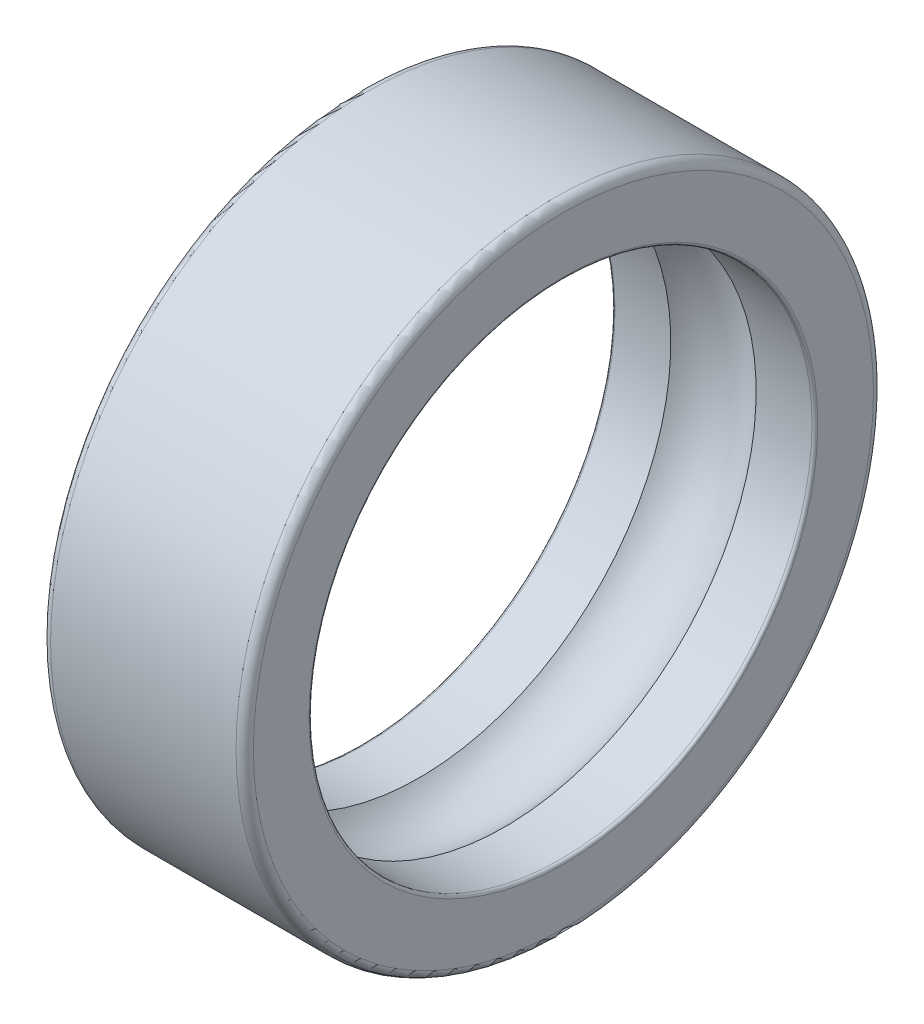
ISO-10303-21;
HEADER;
FILE_DESCRIPTION(('STEP AP214'),'2;1');
FILE_NAME('part.step','',(''),(''),'','','');
FILE_SCHEMA(('AUTOMOTIVE_DESIGN { 1 0 10303 214 1 1 1 1 }'));
ENDSEC;
DATA;
#1=APPLICATION_CONTEXT('core data for automotive mechanical design processes');
#2=APPLICATION_PROTOCOL_DEFINITION('international standard','automotive_design',2000,#1);
#3=PRODUCT_CONTEXT('',#1,'mechanical');
#4=PRODUCT('Part','Part','',(#3));
#5=PRODUCT_RELATED_PRODUCT_CATEGORY('part','',(#4));
#6=PRODUCT_DEFINITION_FORMATION('','',#4);
#7=PRODUCT_DEFINITION_CONTEXT('part definition',#1,'design');
#8=PRODUCT_DEFINITION('design','',#6,#7);
#9=PRODUCT_DEFINITION_SHAPE('','',#8);
#10=(LENGTH_UNIT() NAMED_UNIT(*) SI_UNIT(.MILLI.,.METRE.));
#11=(NAMED_UNIT(*) PLANE_ANGLE_UNIT() SI_UNIT($,.RADIAN.));
#12=(NAMED_UNIT(*) SI_UNIT($,.STERADIAN.) SOLID_ANGLE_UNIT());
#13=UNCERTAINTY_MEASURE_WITH_UNIT(LENGTH_MEASURE(1.E-05),#10,'distance_accuracy_value','');
#14=(GEOMETRIC_REPRESENTATION_CONTEXT(3) GLOBAL_UNCERTAINTY_ASSIGNED_CONTEXT((#13)) GLOBAL_UNIT_ASSIGNED_CONTEXT((#10,
#11,#12)) REPRESENTATION_CONTEXT('',''));
#15=CARTESIAN_POINT('',(0.,0.,0.));
#16=DIRECTION('',(0.,0.,1.));
#17=DIRECTION('',(1.,0.,0.));
#18=AXIS2_PLACEMENT_3D('',#15,#16,#17);
#19=CARTESIAN_POINT('',(3.5,0.,0.));
#20=DIRECTION('',(1.,0.,0.));
#21=DIRECTION('',(0.,1.,0.));
#22=AXIS2_PLACEMENT_3D('',#19,#20,#21);
#23=TOROIDAL_SURFACE('',#22,7.35,1.9845);
#24=CARTESIAN_POINT('',(4.9728680355008,0.,0.));
#25=DIRECTION('',(-1.,0.,0.));
#26=DIRECTION('',(0.,0.,1.));
#27=AXIS2_PLACEMENT_3D('',#24,#25,#26);
#28=CIRCLE('',#27,8.68);
#29=CARTESIAN_POINT('',(4.9728680355008,0.,8.68));
#30=VERTEX_POINT('',#29);
#31=EDGE_CURVE('E215',#30,#30,#28,.F.);
#32=ORIENTED_EDGE('',*,*,#31,.T.);
#33=EDGE_LOOP('',(#32));
#34=FACE_BOUND('',#33,.T.);
#35=CARTESIAN_POINT('',(2.0271319644992,0.,0.));
#36=DIRECTION('',(-1.,0.,0.));
#37=DIRECTION('',(0.,0.,1.));
#38=AXIS2_PLACEMENT_3D('',#35,#36,#37);
#39=CIRCLE('',#38,8.68);
#40=CARTESIAN_POINT('',(2.0271319644992,0.,8.68));
#41=VERTEX_POINT('',#40);
#42=EDGE_CURVE('E217',#41,#41,#39,.T.);
#43=ORIENTED_EDGE('',*,*,#42,.T.);
#44=EDGE_LOOP('',(#43));
#45=FACE_BOUND('',#44,.T.);
#46=ADVANCED_FACE('F16',(#34,#45),#23,.F.);
#47=CARTESIAN_POINT('',(50.,0.,0.));
#48=DIRECTION('',(-1.,0.,0.));
#49=DIRECTION('',(0.,0.,1.));
#50=AXIS2_PLACEMENT_3D('',#47,#48,#49);
#51=CYLINDRICAL_SURFACE('',#50,8.68);
#52=CARTESIAN_POINT('',(6.9,0.,0.));
#53=DIRECTION('',(1.,0.,0.));
#54=DIRECTION('',(0.,1.,0.));
#55=AXIS2_PLACEMENT_3D('',#52,#53,#54);
#56=CIRCLE('',#55,8.68);
#57=CARTESIAN_POINT('',(6.9,8.68,0.));
#58=VERTEX_POINT('',#57);
#59=EDGE_CURVE('E222',#58,#58,#56,.F.);
#60=ORIENTED_EDGE('',*,*,#59,.F.);
#61=EDGE_LOOP('',(#60));
#62=FACE_BOUND('',#61,.T.);
#63=ORIENTED_EDGE('',*,*,#31,.F.);
#64=EDGE_LOOP('',(#63));
#65=FACE_BOUND('',#64,.T.);
#66=ADVANCED_FACE('F249',(#62,#65),#51,.F.);
#67=CARTESIAN_POINT('',(50.,0.,0.));
#68=DIRECTION('',(-1.,0.,0.));
#69=DIRECTION('',(0.,0.,1.));
#70=AXIS2_PLACEMENT_3D('',#67,#68,#69);
#71=CYLINDRICAL_SURFACE('',#70,8.68);
#72=ORIENTED_EDGE('',*,*,#42,.F.);
#73=EDGE_LOOP('',(#72));
#74=FACE_BOUND('',#73,.T.);
#75=CARTESIAN_POINT('',(0.100000000000003,0.,0.));
#76=DIRECTION('',(1.,0.,0.));
#77=DIRECTION('',(0.,1.,0.));
#78=AXIS2_PLACEMENT_3D('',#75,#76,#77);
#79=CIRCLE('',#78,8.68);
#80=CARTESIAN_POINT('',(0.100000000000003,8.68,0.));
#81=VERTEX_POINT('',#80);
#82=EDGE_CURVE('E67',#81,#81,#79,.T.);
#83=ORIENTED_EDGE('',*,*,#82,.F.);
#84=EDGE_LOOP('',(#83));
#85=FACE_BOUND('',#84,.T.);
#86=ADVANCED_FACE('F236',(#74,#85),#71,.F.);
#87=CARTESIAN_POINT('',(6.90000000000016,0.,0.));
#88=DIRECTION('',(1.,0.,0.));
#89=DIRECTION('',(0.,1.,0.));
#90=AXIS2_PLACEMENT_3D('',#87,#88,#89);
#91=TOROIDAL_SURFACE('',#90,8.78,0.1);
#92=ORIENTED_EDGE('',*,*,#59,.T.);
#93=EDGE_LOOP('',(#92));
#94=FACE_BOUND('',#93,.T.);
#95=CARTESIAN_POINT('',(7.00000000000016,0.,0.));
#96=DIRECTION('',(1.,0.,0.));
#97=DIRECTION('',(0.,0.,1.));
#98=AXIS2_PLACEMENT_3D('',#95,#96,#97);
#99=CIRCLE('',#98,8.78);
#100=CARTESIAN_POINT('',(7.0000000000001,0.,-8.78));
#101=VERTEX_POINT('',#100);
#102=CARTESIAN_POINT('',(7.0000000000001,0.,8.78));
#103=VERTEX_POINT('',#102);
#104=EDGE_CURVE('E56',#101,#103,#99,.F.);
#105=ORIENTED_EDGE('',*,*,#104,.F.);
#106=CARTESIAN_POINT('',(7.00000000000016,0.,0.));
#107=DIRECTION('',(1.,0.,0.));
#108=DIRECTION('',(0.,0.,-1.));
#109=AXIS2_PLACEMENT_3D('',#106,#107,#108);
#110=CIRCLE('',#109,8.78);
#111=EDGE_CURVE('E54',#103,#101,#110,.F.);
#112=ORIENTED_EDGE('',*,*,#111,.F.);
#113=EDGE_LOOP('',(#105,#112));
#114=FACE_BOUND('',#113,.T.);
#115=ADVANCED_FACE('F58',(#94,#114),#91,.T.);
#116=CARTESIAN_POINT('',(0.0999999999999203,0.,0.));
#117=DIRECTION('',(1.,0.,0.));
#118=DIRECTION('',(0.,1.,0.));
#119=AXIS2_PLACEMENT_3D('',#116,#117,#118);
#120=TOROIDAL_SURFACE('',#119,8.78,0.1);
#121=CARTESIAN_POINT('',(0.,0.,0.));
#122=DIRECTION('',(-1.,0.,0.));
#123=DIRECTION('',(0.,0.,1.));
#124=AXIS2_PLACEMENT_3D('',#121,#122,#123);
#125=CIRCLE('',#124,8.78);
#126=CARTESIAN_POINT('',(0.,0.,-8.78));
#127=VERTEX_POINT('',#126);
#128=CARTESIAN_POINT('',(0.,0.,8.78));
#129=VERTEX_POINT('',#128);
#130=EDGE_CURVE('E61',#127,#129,#125,.F.);
#131=ORIENTED_EDGE('',*,*,#130,.F.);
#132=CARTESIAN_POINT('',(0.,0.,0.));
#133=DIRECTION('',(-1.,0.,0.));
#134=DIRECTION('',(0.,0.,-1.));
#135=AXIS2_PLACEMENT_3D('',#132,#133,#134);
#136=CIRCLE('',#135,8.78);
#137=EDGE_CURVE('E150',#129,#127,#136,.F.);
#138=ORIENTED_EDGE('',*,*,#137,.F.);
#139=EDGE_LOOP('',(#131,#138));
#140=FACE_BOUND('',#139,.T.);
#141=ORIENTED_EDGE('',*,*,#82,.T.);
#142=EDGE_LOOP('',(#141));
#143=FACE_BOUND('',#142,.T.);
#144=ADVANCED_FACE('F87',(#140,#143),#120,.T.);
#145=CARTESIAN_POINT('',(7.,8.78,0.));
#146=DIRECTION('',(1.,0.,0.));
#147=DIRECTION('',(0.,0.,-1.));
#148=AXIS2_PLACEMENT_3D('',#145,#146,#147);
#149=PLANE('',#148);
#150=ORIENTED_EDGE('',*,*,#111,.T.);
#151=ORIENTED_EDGE('',*,*,#104,.T.);
#152=EDGE_LOOP('',(#150,#151));
#153=FACE_BOUND('',#152,.T.);
#154=CARTESIAN_POINT('',(7.00000000000013,0.,0.));
#155=DIRECTION('',(-1.,0.,0.));
#156=DIRECTION('',(0.,0.,1.));
#157=AXIS2_PLACEMENT_3D('',#154,#155,#156);
#158=CIRCLE('',#157,10.7);
#159=CARTESIAN_POINT('',(7.00000000000008,0.,10.7));
#160=VERTEX_POINT('',#159);
#161=CARTESIAN_POINT('',(7.00000000000008,0.,-10.7));
#162=VERTEX_POINT('',#161);
#163=EDGE_CURVE('E112',#160,#162,#158,.T.);
#164=ORIENTED_EDGE('',*,*,#163,.F.);
#165=CARTESIAN_POINT('',(7.00000000000013,0.,0.));
#166=DIRECTION('',(-1.,0.,0.));
#167=DIRECTION('',(0.,0.,-1.));
#168=AXIS2_PLACEMENT_3D('',#165,#166,#167);
#169=CIRCLE('',#168,10.7);
#170=EDGE_CURVE('E187',#162,#160,#169,.T.);
#171=ORIENTED_EDGE('',*,*,#170,.F.);
#172=EDGE_LOOP('',(#164,#171));
#173=FACE_BOUND('',#172,.T.);
#174=ADVANCED_FACE('F65',(#153,#173),#149,.T.);
#175=CARTESIAN_POINT('',(0.,10.7,0.));
#176=DIRECTION('',(-1.,0.,0.));
#177=DIRECTION('',(0.,0.,1.));
#178=AXIS2_PLACEMENT_3D('',#175,#176,#177);
#179=PLANE('',#178);
#180=CARTESIAN_POINT('',(0.,0.,0.));
#181=DIRECTION('',(1.,0.,0.));
#182=DIRECTION('',(0.,0.,-1.));
#183=AXIS2_PLACEMENT_3D('',#180,#181,#182);
#184=CIRCLE('',#183,10.7);
#185=CARTESIAN_POINT('',(0.,0.,-10.7));
#186=VERTEX_POINT('',#185);
#187=CARTESIAN_POINT('',(0.,0.,10.7));
#188=VERTEX_POINT('',#187);
#189=EDGE_CURVE('E160',#186,#188,#184,.T.);
#190=ORIENTED_EDGE('',*,*,#189,.F.);
#191=CARTESIAN_POINT('',(0.,0.,0.));
#192=DIRECTION('',(1.,0.,0.));
#193=DIRECTION('',(0.,0.,1.));
#194=AXIS2_PLACEMENT_3D('',#191,#192,#193);
#195=CIRCLE('',#194,10.7);
#196=EDGE_CURVE('E36',#188,#186,#195,.T.);
#197=ORIENTED_EDGE('',*,*,#196,.F.);
#198=EDGE_LOOP('',(#190,#197));
#199=FACE_BOUND('',#198,.T.);
#200=ORIENTED_EDGE('',*,*,#130,.T.);
#201=ORIENTED_EDGE('',*,*,#137,.T.);
#202=EDGE_LOOP('',(#200,#201));
#203=FACE_BOUND('',#202,.T.);
#204=ADVANCED_FACE('F86',(#199,#203),#179,.T.);
#205=CARTESIAN_POINT('',(6.70000000000013,0.,0.));
#206=DIRECTION('',(1.,0.,0.));
#207=DIRECTION('',(0.,-1.,0.));
#208=AXIS2_PLACEMENT_3D('',#205,#206,#207);
#209=TOROIDAL_SURFACE('',#208,10.7,0.3);
#210=CARTESIAN_POINT('',(6.70000000000013,0.,0.));
#211=DIRECTION('',(-1.,0.,0.));
#212=DIRECTION('',(0.,0.,1.));
#213=AXIS2_PLACEMENT_3D('',#210,#211,#212);
#214=CIRCLE('',#213,11.);
#215=CARTESIAN_POINT('',(6.70000000000013,0.,11.));
#216=VERTEX_POINT('',#215);
#217=EDGE_CURVE('E28',#216,#216,#214,.T.);
#218=ORIENTED_EDGE('',*,*,#217,.F.);
#219=EDGE_LOOP('',(#218));
#220=FACE_BOUND('',#219,.T.);
#221=ORIENTED_EDGE('',*,*,#163,.T.);
#222=ORIENTED_EDGE('',*,*,#170,.T.);
#223=EDGE_LOOP('',(#221,#222));
#224=FACE_BOUND('',#223,.T.);
#225=ADVANCED_FACE('F117',(#220,#224),#209,.T.);
#226=CARTESIAN_POINT('',(0.299999999999936,0.,0.));
#227=DIRECTION('',(1.,0.,0.));
#228=DIRECTION('',(0.,-1.,0.));
#229=AXIS2_PLACEMENT_3D('',#226,#227,#228);
#230=TOROIDAL_SURFACE('',#229,10.7,0.3);
#231=ORIENTED_EDGE('',*,*,#196,.T.);
#232=ORIENTED_EDGE('',*,*,#189,.T.);
#233=EDGE_LOOP('',(#231,#232));
#234=FACE_BOUND('',#233,.T.);
#235=CARTESIAN_POINT('',(0.300000000000002,0.,0.));
#236=DIRECTION('',(-1.,0.,0.));
#237=DIRECTION('',(0.,0.,1.));
#238=AXIS2_PLACEMENT_3D('',#235,#236,#237);
#239=CIRCLE('',#238,11.);
#240=CARTESIAN_POINT('',(0.300000000000002,0.,11.));
#241=VERTEX_POINT('',#240);
#242=EDGE_CURVE('E11',#241,#241,#239,.F.);
#243=ORIENTED_EDGE('',*,*,#242,.F.);
#244=EDGE_LOOP('',(#243));
#245=FACE_BOUND('',#244,.T.);
#246=ADVANCED_FACE('F127',(#234,#245),#230,.T.);
#247=CARTESIAN_POINT('',(50.,0.,0.));
#248=DIRECTION('',(-1.,0.,0.));
#249=DIRECTION('',(0.,0.,1.));
#250=AXIS2_PLACEMENT_3D('',#247,#248,#249);
#251=CYLINDRICAL_SURFACE('',#250,11.);
#252=ORIENTED_EDGE('',*,*,#242,.T.);
#253=EDGE_LOOP('',(#252));
#254=FACE_BOUND('',#253,.T.);
#255=ORIENTED_EDGE('',*,*,#217,.T.);
#256=EDGE_LOOP('',(#255));
#257=FACE_BOUND('',#256,.T.);
#258=ADVANCED_FACE('F260',(#254,#257),#251,.T.);
#259=CLOSED_SHELL('',(#46,#66,#86,#115,#144,#174,#204,#225,#246,#258));
#260=MANIFOLD_SOLID_BREP('B1',#259);
#261=ADVANCED_BREP_SHAPE_REPRESENTATION('',(#18,#260),#14);
#262=SHAPE_DEFINITION_REPRESENTATION(#9,#261);
ENDSEC;
END-ISO-10303-21;
